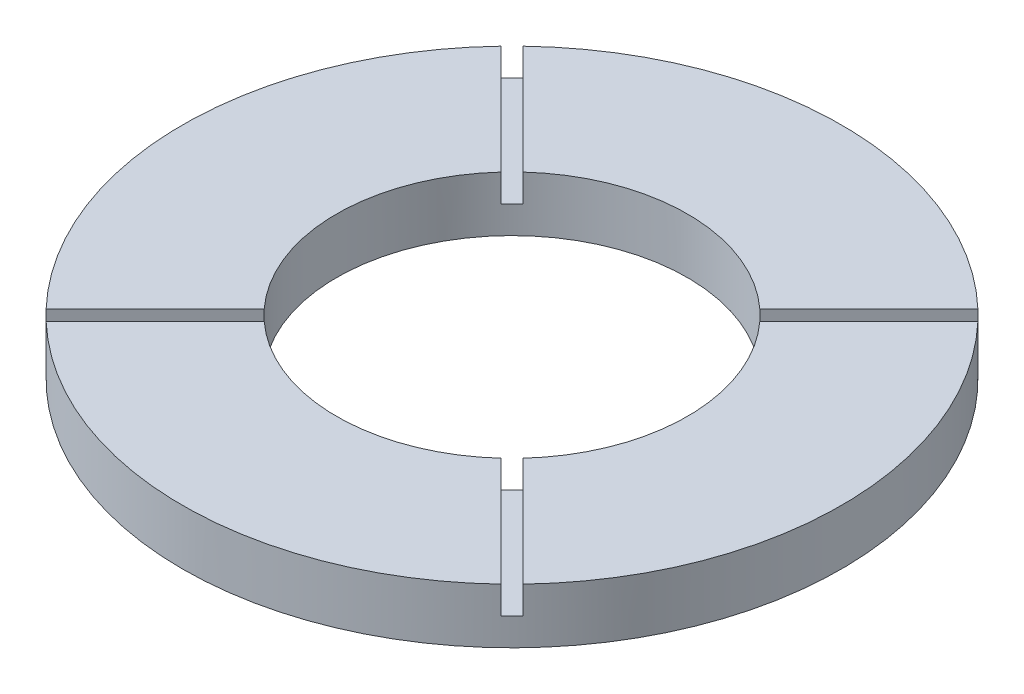
ISO-10303-21;
HEADER;
FILE_DESCRIPTION(('STEP AP214'),'2;1');
FILE_NAME('part.step','',(''),(''),'','','');
FILE_SCHEMA(('AUTOMOTIVE_DESIGN { 1 0 10303 214 1 1 1 1 }'));
ENDSEC;
DATA;
#1=APPLICATION_CONTEXT('core data for automotive mechanical design processes');
#2=APPLICATION_PROTOCOL_DEFINITION('international standard','automotive_design',2000,#1);
#3=PRODUCT_CONTEXT('',#1,'mechanical');
#4=PRODUCT('Part','Part','',(#3));
#5=PRODUCT_RELATED_PRODUCT_CATEGORY('part','',(#4));
#6=PRODUCT_DEFINITION_FORMATION('','',#4);
#7=PRODUCT_DEFINITION_CONTEXT('part definition',#1,'design');
#8=PRODUCT_DEFINITION('design','',#6,#7);
#9=PRODUCT_DEFINITION_SHAPE('','',#8);
#10=(LENGTH_UNIT() NAMED_UNIT(*) SI_UNIT(.MILLI.,.METRE.));
#11=(NAMED_UNIT(*) PLANE_ANGLE_UNIT() SI_UNIT($,.RADIAN.));
#12=(NAMED_UNIT(*) SI_UNIT($,.STERADIAN.) SOLID_ANGLE_UNIT());
#13=UNCERTAINTY_MEASURE_WITH_UNIT(LENGTH_MEASURE(1.E-05),#10,'distance_accuracy_value','');
#14=(GEOMETRIC_REPRESENTATION_CONTEXT(3) GLOBAL_UNCERTAINTY_ASSIGNED_CONTEXT((#13)) GLOBAL_UNIT_ASSIGNED_CONTEXT((#10,
#11,#12)) REPRESENTATION_CONTEXT('',''));
#15=CARTESIAN_POINT('',(0.,0.,0.));
#16=DIRECTION('',(0.,0.,1.));
#17=DIRECTION('',(1.,0.,0.));
#18=AXIS2_PLACEMENT_3D('',#15,#16,#17);
#19=CARTESIAN_POINT('',(0.,12.7,0.));
#20=DIRECTION('',(0.,1.,0.));
#21=DIRECTION('',(0.,0.,1.));
#22=AXIS2_PLACEMENT_3D('',#19,#20,#21);
#23=PLANE('',#22);
#24=DIRECTION('',(0.707106781186543,0.,-0.707106781186552));
#25=VECTOR('',#24,1.);
#26=CARTESIAN_POINT('',(-25.7014930184937,12.7,28.1800437079154));
#27=LINE('',#26,#25);
#28=CARTESIAN_POINT('',(-52.4303897259785,12.7,54.9089404154006));
#29=VERTEX_POINT('',#28);
#30=CARTESIAN_POINT('',(-27.3090139490453,12.7,29.787564638467));
#31=VERTEX_POINT('',#30);
#32=EDGE_CURVE('E246',#29,#31,#27,.T.);
#33=ORIENTED_EDGE('',*,*,#32,.F.);
#34=CARTESIAN_POINT('',(0.,12.7,0.));
#35=DIRECTION('',(0.,1.,0.));
#36=DIRECTION('',(0.,0.,1.));
#37=AXIS2_PLACEMENT_3D('',#34,#35,#36);
#38=CIRCLE('',#37,75.9206);
#39=CARTESIAN_POINT('',(52.4303897259886,12.7,54.9089404153909));
#40=VERTEX_POINT('',#39);
#41=EDGE_CURVE('E189',#29,#40,#38,.T.);
#42=ORIENTED_EDGE('',*,*,#41,.T.);
#43=DIRECTION('',(0.707106781186552,0.,0.707106781186543));
#44=VECTOR('',#43,1.);
#45=CARTESIAN_POINT('',(25.7014930185064,12.7,28.180043707909));
#46=LINE('',#45,#44);
#47=CARTESIAN_POINT('',(27.3090139490553,12.7,29.7875646384578));
#48=VERTEX_POINT('',#47);
#49=EDGE_CURVE('E315',#48,#40,#46,.T.);
#50=ORIENTED_EDGE('',*,*,#49,.F.);
#51=CARTESIAN_POINT('',(0.,12.7,0.));
#52=DIRECTION('',(0.,1.,0.));
#53=DIRECTION('',(0.,0.,1.));
#54=AXIS2_PLACEMENT_3D('',#51,#52,#53);
#55=CIRCLE('',#54,40.4114);
#56=EDGE_CURVE('E254',#31,#48,#55,.T.);
#57=ORIENTED_EDGE('',*,*,#56,.F.);
#58=EDGE_LOOP('',(#33,#42,#50,#57));
#59=FACE_BOUND('',#58,.T.);
#60=ADVANCED_FACE('F43',(#59),#23,.T.);
#61=DIRECTION('',(-0.707106781186552,0.,-0.707106781186543));
#62=VECTOR('',#61,1.);
#63=CARTESIAN_POINT('',(28.1800437079215,12.7,25.7014930184939));
#64=LINE('',#63,#62);
#65=CARTESIAN_POINT('',(54.9089404154034,12.7,52.4303897259755));
#66=VERTEX_POINT('',#65);
#67=CARTESIAN_POINT('',(29.7875646384698,12.7,27.3090139490422));
#68=VERTEX_POINT('',#67);
#69=EDGE_CURVE('E319',#66,#68,#64,.T.);
#70=ORIENTED_EDGE('',*,*,#69,.F.);
#71=CARTESIAN_POINT('',(54.908940415394,12.7,-52.4303897259854));
#72=VERTEX_POINT('',#71);
#73=EDGE_CURVE('E194',#66,#72,#38,.T.);
#74=ORIENTED_EDGE('',*,*,#73,.T.);
#75=DIRECTION('',(0.707106781186543,0.,-0.707106781186552));
#76=VECTOR('',#75,1.);
#77=CARTESIAN_POINT('',(28.1800437079151,12.7,-25.7014930185062));
#78=LINE('',#77,#76);
#79=CARTESIAN_POINT('',(29.7875646384609,12.7,-27.309013949052));
#80=VERTEX_POINT('',#79);
#81=EDGE_CURVE('E328',#80,#72,#78,.T.);
#82=ORIENTED_EDGE('',*,*,#81,.F.);
#83=EDGE_CURVE('E204',#68,#80,#55,.T.);
#84=ORIENTED_EDGE('',*,*,#83,.F.);
#85=EDGE_LOOP('',(#70,#74,#82,#84));
#86=FACE_BOUND('',#85,.T.);
#87=ADVANCED_FACE('F346',(#86),#23,.T.);
#88=DIRECTION('',(-0.707106781186543,0.,0.707106781186552));
#89=VECTOR('',#88,1.);
#90=CARTESIAN_POINT('',(25.7014930185,12.7,-28.1800437079212));
#91=LINE('',#90,#89);
#92=CARTESIAN_POINT('',(52.4303897259788,12.7,-54.9089404154003));
#93=VERTEX_POINT('',#92);
#94=CARTESIAN_POINT('',(27.3090139490455,12.7,-29.7875646384668));
#95=VERTEX_POINT('',#94);
#96=EDGE_CURVE('E180',#93,#95,#91,.T.);
#97=ORIENTED_EDGE('',*,*,#96,.F.);
#98=CARTESIAN_POINT('',(-52.4303897259824,12.7,-54.9089404153968));
#99=VERTEX_POINT('',#98);
#100=EDGE_CURVE('E188',#93,#99,#38,.T.);
#101=ORIENTED_EDGE('',*,*,#100,.T.);
#102=DIRECTION('',(-0.707106781186552,0.,-0.707106781186544));
#103=VECTOR('',#102,1.);
#104=CARTESIAN_POINT('',(-25.7014930185001,12.7,-28.1800437079149));
#105=LINE('',#104,#103);
#106=CARTESIAN_POINT('',(-27.3090139490489,12.7,-29.7875646384637));
#107=VERTEX_POINT('',#106);
#108=EDGE_CURVE('E179',#107,#99,#105,.T.);
#109=ORIENTED_EDGE('',*,*,#108,.F.);
#110=EDGE_CURVE('E253',#95,#107,#55,.T.);
#111=ORIENTED_EDGE('',*,*,#110,.F.);
#112=EDGE_LOOP('',(#97,#101,#109,#111));
#113=FACE_BOUND('',#112,.T.);
#114=ADVANCED_FACE('F376',(#113),#23,.T.);
#115=CARTESIAN_POINT('',(0.,12.7,0.));
#116=DIRECTION('',(0.,-1.,0.));
#117=DIRECTION('',(0.,0.,-1.));
#118=AXIS2_PLACEMENT_3D('',#115,#116,#117);
#119=CYLINDRICAL_SURFACE('',#118,75.9206);
#120=ORIENTED_EDGE('',*,*,#41,.F.);
#121=DIRECTION('',(0.,-1.,0.));
#122=VECTOR('',#121,1.);
#123=CARTESIAN_POINT('',(-52.4303897259785,12.7,54.9089404154006));
#124=LINE('',#123,#122);
#125=CARTESIAN_POINT('',(-52.4303897259785,6.35,54.9089404154005));
#126=VERTEX_POINT('',#125);
#127=EDGE_CURVE('E260',#29,#126,#124,.T.);
#128=ORIENTED_EDGE('',*,*,#127,.T.);
#129=CARTESIAN_POINT('',(0.,6.35,0.));
#130=DIRECTION('',(0.,-1.,0.));
#131=DIRECTION('',(0.,0.,-1.));
#132=AXIS2_PLACEMENT_3D('',#129,#130,#131);
#133=CIRCLE('',#132,75.9206);
#134=CARTESIAN_POINT('',(-54.9089404153937,6.35,52.4303897259856));
#135=VERTEX_POINT('',#134);
#136=EDGE_CURVE('E266',#126,#135,#133,.T.);
#137=ORIENTED_EDGE('',*,*,#136,.T.);
#138=DIRECTION('',(0.,-1.,0.));
#139=VECTOR('',#138,1.);
#140=CARTESIAN_POINT('',(-54.9089404153937,12.7,52.4303897259856));
#141=LINE('',#140,#139);
#142=CARTESIAN_POINT('',(-54.9089404153937,12.7,52.4303897259856));
#143=VERTEX_POINT('',#142);
#144=EDGE_CURVE('E186',#135,#143,#141,.F.);
#145=ORIENTED_EDGE('',*,*,#144,.T.);
#146=CARTESIAN_POINT('',(-54.9089404153974,12.7,-52.4303897259818));
#147=VERTEX_POINT('',#146);
#148=EDGE_CURVE('E175',#147,#143,#38,.T.);
#149=ORIENTED_EDGE('',*,*,#148,.F.);
#150=DIRECTION('',(0.,-1.,0.));
#151=VECTOR('',#150,1.);
#152=CARTESIAN_POINT('',(-54.9089404153974,12.7,-52.4303897259817));
#153=LINE('',#152,#151);
#154=CARTESIAN_POINT('',(-54.9089404153974,6.35,-52.4303897259817));
#155=VERTEX_POINT('',#154);
#156=EDGE_CURVE('E156',#147,#155,#153,.T.);
#157=ORIENTED_EDGE('',*,*,#156,.T.);
#158=CARTESIAN_POINT('',(0.,6.35,0.));
#159=DIRECTION('',(0.,-1.,0.));
#160=DIRECTION('',(0.,0.,-1.));
#161=AXIS2_PLACEMENT_3D('',#158,#159,#160);
#162=CIRCLE('',#161,75.9206);
#163=CARTESIAN_POINT('',(-52.4303897259824,6.35,-54.9089404153968));
#164=VERTEX_POINT('',#163);
#165=EDGE_CURVE('E295',#155,#164,#162,.T.);
#166=ORIENTED_EDGE('',*,*,#165,.T.);
#167=DIRECTION('',(0.,-1.,0.));
#168=VECTOR('',#167,1.);
#169=CARTESIAN_POINT('',(-52.4303897259824,12.7,-54.9089404153968));
#170=LINE('',#169,#168);
#171=EDGE_CURVE('E168',#164,#99,#170,.F.);
#172=ORIENTED_EDGE('',*,*,#171,.T.);
#173=ORIENTED_EDGE('',*,*,#100,.F.);
#174=DIRECTION('',(0.,-1.,0.));
#175=VECTOR('',#174,1.);
#176=CARTESIAN_POINT('',(52.4303897259787,12.7,-54.9089404154003));
#177=LINE('',#176,#175);
#178=CARTESIAN_POINT('',(52.4303897259788,6.35,-54.9089404154003));
#179=VERTEX_POINT('',#178);
#180=EDGE_CURVE('E281',#93,#179,#177,.T.);
#181=ORIENTED_EDGE('',*,*,#180,.T.);
#182=CARTESIAN_POINT('',(0.,6.35,0.));
#183=DIRECTION('',(0.,-1.,0.));
#184=DIRECTION('',(0.,0.,-1.));
#185=AXIS2_PLACEMENT_3D('',#182,#183,#184);
#186=CIRCLE('',#185,75.9206);
#187=CARTESIAN_POINT('',(54.908940415394,6.35,-52.4303897259854));
#188=VERTEX_POINT('',#187);
#189=EDGE_CURVE('E167',#179,#188,#186,.T.);
#190=ORIENTED_EDGE('',*,*,#189,.T.);
#191=DIRECTION('',(0.,-1.,0.));
#192=VECTOR('',#191,1.);
#193=CARTESIAN_POINT('',(54.908940415394,12.7,-52.4303897259854));
#194=LINE('',#193,#192);
#195=EDGE_CURVE('E285',#188,#72,#194,.F.);
#196=ORIENTED_EDGE('',*,*,#195,.T.);
#197=ORIENTED_EDGE('',*,*,#73,.F.);
#198=DIRECTION('',(0.,-1.,0.));
#199=VECTOR('',#198,1.);
#200=CARTESIAN_POINT('',(54.9089404154034,12.7,52.4303897259755));
#201=LINE('',#200,#199);
#202=CARTESIAN_POINT('',(54.9089404154034,6.35,52.4303897259755));
#203=VERTEX_POINT('',#202);
#204=EDGE_CURVE('E269',#66,#203,#201,.T.);
#205=ORIENTED_EDGE('',*,*,#204,.T.);
#206=CARTESIAN_POINT('',(0.,6.35,0.));
#207=DIRECTION('',(0.,-1.,0.));
#208=DIRECTION('',(0.,0.,-1.));
#209=AXIS2_PLACEMENT_3D('',#206,#207,#208);
#210=CIRCLE('',#209,75.9206);
#211=CARTESIAN_POINT('',(52.4303897259886,6.35,54.9089404153909));
#212=VERTEX_POINT('',#211);
#213=EDGE_CURVE('E277',#203,#212,#210,.T.);
#214=ORIENTED_EDGE('',*,*,#213,.T.);
#215=DIRECTION('',(0.,-1.,0.));
#216=VECTOR('',#215,1.);
#217=CARTESIAN_POINT('',(52.4303897259886,12.7,54.9089404153909));
#218=LINE('',#217,#216);
#219=EDGE_CURVE('E273',#212,#40,#218,.F.);
#220=ORIENTED_EDGE('',*,*,#219,.T.);
#221=EDGE_LOOP('',(#120,#128,#137,#145,#149,#157,#166,#172,#173,#181,#190,#196,#197,#205,#214,#220));
#222=FACE_BOUND('',#221,.T.);
#223=CARTESIAN_POINT('',(0.,0.,0.));
#224=DIRECTION('',(0.,1.,0.));
#225=DIRECTION('',(0.,0.,1.));
#226=AXIS2_PLACEMENT_3D('',#223,#224,#225);
#227=CIRCLE('',#226,75.9206);
#228=CARTESIAN_POINT('',(0.,0.,75.9206));
#229=VERTEX_POINT('',#228);
#230=EDGE_CURVE('E196',#229,#229,#227,.T.);
#231=ORIENTED_EDGE('',*,*,#230,.T.);
#232=EDGE_LOOP('',(#231));
#233=FACE_BOUND('',#232,.T.);
#234=ADVANCED_FACE('F45',(#222,#233),#119,.T.);
#235=DIRECTION('',(-0.707106781186543,0.,0.707106781186552));
#236=VECTOR('',#235,1.);
#237=CARTESIAN_POINT('',(-28.1800437079088,12.7,25.7014930185003));
#238=LINE('',#237,#236);
#239=CARTESIAN_POINT('',(-29.7875646384606,12.7,27.3090139490522));
#240=VERTEX_POINT('',#239);
#241=EDGE_CURVE('E240',#240,#143,#238,.T.);
#242=ORIENTED_EDGE('',*,*,#241,.F.);
#243=CARTESIAN_POINT('',(-29.787564638464,12.7,-27.3090139490486));
#244=VERTEX_POINT('',#243);
#245=EDGE_CURVE('E177',#244,#240,#55,.T.);
#246=ORIENTED_EDGE('',*,*,#245,.F.);
#247=DIRECTION('',(0.707106781186552,0.,0.707106781186543));
#248=VECTOR('',#247,1.);
#249=CARTESIAN_POINT('',(-28.1800437079152,12.7,-25.7014930184998));
#250=LINE('',#249,#248);
#251=EDGE_CURVE('E160',#147,#244,#250,.T.);
#252=ORIENTED_EDGE('',*,*,#251,.F.);
#253=ORIENTED_EDGE('',*,*,#148,.T.);
#254=EDGE_LOOP('',(#242,#246,#252,#253));
#255=FACE_BOUND('',#254,.T.);
#256=ADVANCED_FACE('F174',(#255),#23,.T.);
#257=CARTESIAN_POINT('',(0.,0.,0.));
#258=DIRECTION('',(0.,1.,0.));
#259=DIRECTION('',(0.,0.,1.));
#260=AXIS2_PLACEMENT_3D('',#257,#258,#259);
#261=PLANE('',#260);
#262=CARTESIAN_POINT('',(0.,0.,0.));
#263=DIRECTION('',(0.,1.,0.));
#264=DIRECTION('',(0.,0.,1.));
#265=AXIS2_PLACEMENT_3D('',#262,#263,#264);
#266=CIRCLE('',#265,40.4114);
#267=CARTESIAN_POINT('',(0.,0.,40.4114));
#268=VERTEX_POINT('',#267);
#269=EDGE_CURVE('E199',#268,#268,#266,.T.);
#270=ORIENTED_EDGE('',*,*,#269,.T.);
#271=EDGE_LOOP('',(#270));
#272=FACE_BOUND('',#271,.T.);
#273=ORIENTED_EDGE('',*,*,#230,.F.);
#274=EDGE_LOOP('',(#273));
#275=FACE_BOUND('',#274,.T.);
#276=ADVANCED_FACE('F379',(#272,#275),#261,.F.);
#277=CARTESIAN_POINT('',(0.,12.7,0.));
#278=DIRECTION('',(0.,-1.,0.));
#279=DIRECTION('',(0.,0.,-1.));
#280=AXIS2_PLACEMENT_3D('',#277,#278,#279);
#281=CYLINDRICAL_SURFACE('',#280,40.4114);
#282=DIRECTION('',(0.,-1.,0.));
#283=VECTOR('',#282,1.);
#284=CARTESIAN_POINT('',(-27.3090139490453,12.7,29.787564638467));
#285=LINE('',#284,#283);
#286=CARTESIAN_POINT('',(-27.3090139490453,6.35,29.787564638467));
#287=VERTEX_POINT('',#286);
#288=EDGE_CURVE('E11',#31,#287,#285,.T.);
#289=ORIENTED_EDGE('',*,*,#288,.F.);
#290=ORIENTED_EDGE('',*,*,#56,.T.);
#291=DIRECTION('',(0.,-1.,0.));
#292=VECTOR('',#291,1.);
#293=CARTESIAN_POINT('',(27.3090139490553,12.7,29.7875646384578));
#294=LINE('',#293,#292);
#295=CARTESIAN_POINT('',(27.3090139490553,6.35,29.7875646384578));
#296=VERTEX_POINT('',#295);
#297=EDGE_CURVE('E227',#296,#48,#294,.F.);
#298=ORIENTED_EDGE('',*,*,#297,.F.);
#299=CARTESIAN_POINT('',(0.,6.35,0.));
#300=DIRECTION('',(0.,-1.,0.));
#301=DIRECTION('',(0.,0.,-1.));
#302=AXIS2_PLACEMENT_3D('',#299,#300,#301);
#303=CIRCLE('',#302,40.4114);
#304=CARTESIAN_POINT('',(29.7875646384698,6.35,27.3090139490422));
#305=VERTEX_POINT('',#304);
#306=EDGE_CURVE('E224',#305,#296,#303,.T.);
#307=ORIENTED_EDGE('',*,*,#306,.F.);
#308=DIRECTION('',(0.,-1.,0.));
#309=VECTOR('',#308,1.);
#310=CARTESIAN_POINT('',(29.7875646384698,12.7,27.3090139490422));
#311=LINE('',#310,#309);
#312=EDGE_CURVE('E230',#68,#305,#311,.T.);
#313=ORIENTED_EDGE('',*,*,#312,.F.);
#314=ORIENTED_EDGE('',*,*,#83,.T.);
#315=DIRECTION('',(0.,-1.,0.));
#316=VECTOR('',#315,1.);
#317=CARTESIAN_POINT('',(29.7875646384609,12.7,-27.309013949052));
#318=LINE('',#317,#316);
#319=CARTESIAN_POINT('',(29.7875646384609,6.35,-27.309013949052));
#320=VERTEX_POINT('',#319);
#321=EDGE_CURVE('E217',#320,#80,#318,.F.);
#322=ORIENTED_EDGE('',*,*,#321,.F.);
#323=CARTESIAN_POINT('',(0.,6.35,0.));
#324=DIRECTION('',(0.,-1.,0.));
#325=DIRECTION('',(0.,0.,-1.));
#326=AXIS2_PLACEMENT_3D('',#323,#324,#325);
#327=CIRCLE('',#326,40.4114);
#328=CARTESIAN_POINT('',(27.3090139490455,6.35,-29.7875646384668));
#329=VERTEX_POINT('',#328);
#330=EDGE_CURVE('E214',#329,#320,#327,.T.);
#331=ORIENTED_EDGE('',*,*,#330,.F.);
#332=DIRECTION('',(0.,-1.,0.));
#333=VECTOR('',#332,1.);
#334=CARTESIAN_POINT('',(27.3090139490455,12.7,-29.7875646384668));
#335=LINE('',#334,#333);
#336=EDGE_CURVE('E220',#95,#329,#335,.T.);
#337=ORIENTED_EDGE('',*,*,#336,.F.);
#338=ORIENTED_EDGE('',*,*,#110,.T.);
#339=DIRECTION('',(0.,-1.,0.));
#340=VECTOR('',#339,1.);
#341=CARTESIAN_POINT('',(-27.3090139490489,12.7,-29.7875646384637));
#342=LINE('',#341,#340);
#343=CARTESIAN_POINT('',(-27.3090139490489,6.35,-29.7875646384637));
#344=VERTEX_POINT('',#343);
#345=EDGE_CURVE('E208',#344,#107,#342,.F.);
#346=ORIENTED_EDGE('',*,*,#345,.F.);
#347=CARTESIAN_POINT('',(0.,6.35,0.));
#348=DIRECTION('',(0.,-1.,0.));
#349=DIRECTION('',(0.,0.,-1.));
#350=AXIS2_PLACEMENT_3D('',#347,#348,#349);
#351=CIRCLE('',#350,40.4114);
#352=CARTESIAN_POINT('',(-29.787564638464,6.35,-27.3090139490486));
#353=VERTEX_POINT('',#352);
#354=EDGE_CURVE('E205',#353,#344,#351,.T.);
#355=ORIENTED_EDGE('',*,*,#354,.F.);
#356=DIRECTION('',(0.,-1.,0.));
#357=VECTOR('',#356,1.);
#358=CARTESIAN_POINT('',(-29.787564638464,12.7,-27.3090139490486));
#359=LINE('',#358,#357);
#360=EDGE_CURVE('E211',#244,#353,#359,.T.);
#361=ORIENTED_EDGE('',*,*,#360,.F.);
#362=ORIENTED_EDGE('',*,*,#245,.T.);
#363=DIRECTION('',(0.,-1.,0.));
#364=VECTOR('',#363,1.);
#365=CARTESIAN_POINT('',(-29.7875646384606,12.7,27.3090139490522));
#366=LINE('',#365,#364);
#367=CARTESIAN_POINT('',(-29.7875646384606,6.35,27.3090139490522));
#368=VERTEX_POINT('',#367);
#369=EDGE_CURVE('E52',#368,#240,#366,.F.);
#370=ORIENTED_EDGE('',*,*,#369,.F.);
#371=CARTESIAN_POINT('',(0.,6.35,0.));
#372=DIRECTION('',(0.,-1.,0.));
#373=DIRECTION('',(0.,0.,-1.));
#374=AXIS2_PLACEMENT_3D('',#371,#372,#373);
#375=CIRCLE('',#374,40.4114);
#376=EDGE_CURVE('E233',#287,#368,#375,.T.);
#377=ORIENTED_EDGE('',*,*,#376,.F.);
#378=EDGE_LOOP('',(#289,#290,#298,#307,#313,#314,#322,#331,#337,#338,#346,#355,#361,#362,#370,#377));
#379=FACE_BOUND('',#378,.T.);
#380=ORIENTED_EDGE('',*,*,#269,.F.);
#381=EDGE_LOOP('',(#380));
#382=FACE_BOUND('',#381,.T.);
#383=ADVANCED_FACE('F249',(#379,#382),#281,.F.);
#384=CARTESIAN_POINT('',(-28.1800437079152,6.35,-25.7014930184998));
#385=DIRECTION('',(-0.707106781186543,0.,0.707106781186551));
#386=DIRECTION('',(0.707106781186552,0.,0.707106781186544));
#387=AXIS2_PLACEMENT_3D('',#384,#385,#386);
#388=PLANE('',#387);
#389=ORIENTED_EDGE('',*,*,#251,.T.);
#390=ORIENTED_EDGE('',*,*,#360,.T.);
#391=DIRECTION('',(0.707106781186552,0.,0.707106781186543));
#392=VECTOR('',#391,1.);
#393=CARTESIAN_POINT('',(-28.1800437079152,6.35,-25.7014930184998));
#394=LINE('',#393,#392);
#395=EDGE_CURVE('E162',#155,#353,#394,.T.);
#396=ORIENTED_EDGE('',*,*,#395,.F.);
#397=ORIENTED_EDGE('',*,*,#156,.F.);
#398=EDGE_LOOP('',(#389,#390,#396,#397));
#399=FACE_BOUND('',#398,.T.);
#400=ADVANCED_FACE('F158',(#399),#388,.F.);
#401=CARTESIAN_POINT('',(-25.7014930185001,6.35,-28.1800437079149));
#402=DIRECTION('',(0.707106781186543,0.,-0.707106781186552));
#403=DIRECTION('',(-0.707106781186552,0.,-0.707106781186543));
#404=AXIS2_PLACEMENT_3D('',#401,#402,#403);
#405=PLANE('',#404);
#406=DIRECTION('',(-0.707106781186552,0.,-0.707106781186544));
#407=VECTOR('',#406,1.);
#408=CARTESIAN_POINT('',(-25.7014930185001,6.35,-28.1800437079149));
#409=LINE('',#408,#407);
#410=EDGE_CURVE('E298',#344,#164,#409,.T.);
#411=ORIENTED_EDGE('',*,*,#410,.F.);
#412=ORIENTED_EDGE('',*,*,#345,.T.);
#413=ORIENTED_EDGE('',*,*,#108,.T.);
#414=ORIENTED_EDGE('',*,*,#171,.F.);
#415=EDGE_LOOP('',(#411,#412,#413,#414));
#416=FACE_BOUND('',#415,.T.);
#417=ADVANCED_FACE('F397',(#416),#405,.F.);
#418=CARTESIAN_POINT('',(0.,6.35,0.));
#419=DIRECTION('',(0.,-1.,0.));
#420=DIRECTION('',(0.,0.,-1.));
#421=AXIS2_PLACEMENT_3D('',#418,#419,#420);
#422=PLANE('',#421);
#423=ORIENTED_EDGE('',*,*,#395,.T.);
#424=ORIENTED_EDGE('',*,*,#354,.T.);
#425=ORIENTED_EDGE('',*,*,#410,.T.);
#426=ORIENTED_EDGE('',*,*,#165,.F.);
#427=EDGE_LOOP('',(#423,#424,#425,#426));
#428=FACE_BOUND('',#427,.T.);
#429=ADVANCED_FACE('F400',(#428),#422,.F.);
#430=CARTESIAN_POINT('',(25.7014930185,6.35,-28.1800437079212));
#431=DIRECTION('',(-0.707106781186551,0.,-0.707106781186543));
#432=DIRECTION('',(-0.707106781186544,0.,0.707106781186552));
#433=AXIS2_PLACEMENT_3D('',#430,#431,#432);
#434=PLANE('',#433);
#435=ORIENTED_EDGE('',*,*,#96,.T.);
#436=ORIENTED_EDGE('',*,*,#336,.T.);
#437=DIRECTION('',(-0.707106781186543,0.,0.707106781186552));
#438=VECTOR('',#437,1.);
#439=CARTESIAN_POINT('',(25.7014930185,6.35,-28.1800437079212));
#440=LINE('',#439,#438);
#441=EDGE_CURVE('E325',#179,#329,#440,.T.);
#442=ORIENTED_EDGE('',*,*,#441,.F.);
#443=ORIENTED_EDGE('',*,*,#180,.F.);
#444=EDGE_LOOP('',(#435,#436,#442,#443));
#445=FACE_BOUND('',#444,.T.);
#446=ADVANCED_FACE('F403',(#445),#434,.F.);
#447=CARTESIAN_POINT('',(28.1800437079151,6.35,-25.7014930185062));
#448=DIRECTION('',(0.707106781186551,0.,0.707106781186543));
#449=DIRECTION('',(0.707106781186544,0.,-0.707106781186552));
#450=AXIS2_PLACEMENT_3D('',#447,#448,#449);
#451=PLANE('',#450);
#452=DIRECTION('',(0.707106781186543,0.,-0.707106781186552));
#453=VECTOR('',#452,1.);
#454=CARTESIAN_POINT('',(28.1800437079151,6.35,-25.7014930185062));
#455=LINE('',#454,#453);
#456=EDGE_CURVE('E322',#320,#188,#455,.T.);
#457=ORIENTED_EDGE('',*,*,#456,.F.);
#458=ORIENTED_EDGE('',*,*,#321,.T.);
#459=ORIENTED_EDGE('',*,*,#81,.T.);
#460=ORIENTED_EDGE('',*,*,#195,.F.);
#461=EDGE_LOOP('',(#457,#458,#459,#460));
#462=FACE_BOUND('',#461,.T.);
#463=ADVANCED_FACE('F338',(#462),#451,.F.);
#464=CARTESIAN_POINT('',(0.,6.35,0.));
#465=DIRECTION('',(0.,-1.,0.));
#466=DIRECTION('',(0.,0.,-1.));
#467=AXIS2_PLACEMENT_3D('',#464,#465,#466);
#468=PLANE('',#467);
#469=ORIENTED_EDGE('',*,*,#441,.T.);
#470=ORIENTED_EDGE('',*,*,#330,.T.);
#471=ORIENTED_EDGE('',*,*,#456,.T.);
#472=ORIENTED_EDGE('',*,*,#189,.F.);
#473=EDGE_LOOP('',(#469,#470,#471,#472));
#474=FACE_BOUND('',#473,.T.);
#475=ADVANCED_FACE('F405',(#474),#468,.F.);
#476=CARTESIAN_POINT('',(28.1800437079215,6.35,25.7014930184939));
#477=DIRECTION('',(0.707106781186543,0.,-0.707106781186552));
#478=DIRECTION('',(-0.707106781186552,0.,-0.707106781186543));
#479=AXIS2_PLACEMENT_3D('',#476,#477,#478);
#480=PLANE('',#479);
#481=ORIENTED_EDGE('',*,*,#69,.T.);
#482=ORIENTED_EDGE('',*,*,#312,.T.);
#483=DIRECTION('',(-0.707106781186552,0.,-0.707106781186543));
#484=VECTOR('',#483,1.);
#485=CARTESIAN_POINT('',(28.1800437079215,6.35,25.7014930184939));
#486=LINE('',#485,#484);
#487=EDGE_CURVE('E66',#203,#305,#486,.T.);
#488=ORIENTED_EDGE('',*,*,#487,.F.);
#489=ORIENTED_EDGE('',*,*,#204,.F.);
#490=EDGE_LOOP('',(#481,#482,#488,#489));
#491=FACE_BOUND('',#490,.T.);
#492=ADVANCED_FACE('F350',(#491),#480,.F.);
#493=CARTESIAN_POINT('',(25.7014930185064,6.35,28.180043707909));
#494=DIRECTION('',(-0.707106781186543,0.,0.707106781186552));
#495=DIRECTION('',(0.707106781186552,0.,0.707106781186543));
#496=AXIS2_PLACEMENT_3D('',#493,#494,#495);
#497=PLANE('',#496);
#498=DIRECTION('',(0.707106781186552,0.,0.707106781186543));
#499=VECTOR('',#498,1.);
#500=CARTESIAN_POINT('',(25.7014930185064,6.35,28.180043707909));
#501=LINE('',#500,#499);
#502=EDGE_CURVE('E311',#296,#212,#501,.T.);
#503=ORIENTED_EDGE('',*,*,#502,.F.);
#504=ORIENTED_EDGE('',*,*,#297,.T.);
#505=ORIENTED_EDGE('',*,*,#49,.T.);
#506=ORIENTED_EDGE('',*,*,#219,.F.);
#507=EDGE_LOOP('',(#503,#504,#505,#506));
#508=FACE_BOUND('',#507,.T.);
#509=ADVANCED_FACE('F356',(#508),#497,.F.);
#510=CARTESIAN_POINT('',(0.,6.35,0.));
#511=DIRECTION('',(0.,-1.,0.));
#512=DIRECTION('',(0.,0.,-1.));
#513=AXIS2_PLACEMENT_3D('',#510,#511,#512);
#514=PLANE('',#513);
#515=ORIENTED_EDGE('',*,*,#487,.T.);
#516=ORIENTED_EDGE('',*,*,#306,.T.);
#517=ORIENTED_EDGE('',*,*,#502,.T.);
#518=ORIENTED_EDGE('',*,*,#213,.F.);
#519=EDGE_LOOP('',(#515,#516,#517,#518));
#520=FACE_BOUND('',#519,.T.);
#521=ADVANCED_FACE('F354',(#520),#514,.F.);
#522=CARTESIAN_POINT('',(-25.7014930184937,6.35,28.1800437079154));
#523=DIRECTION('',(0.707106781186552,0.,0.707106781186543));
#524=DIRECTION('',(0.707106781186543,0.,-0.707106781186552));
#525=AXIS2_PLACEMENT_3D('',#522,#523,#524);
#526=PLANE('',#525);
#527=ORIENTED_EDGE('',*,*,#32,.T.);
#528=ORIENTED_EDGE('',*,*,#288,.T.);
#529=DIRECTION('',(0.707106781186543,0.,-0.707106781186552));
#530=VECTOR('',#529,1.);
#531=CARTESIAN_POINT('',(-25.7014930184937,6.35,28.1800437079154));
#532=LINE('',#531,#530);
#533=EDGE_CURVE('E59',#126,#287,#532,.T.);
#534=ORIENTED_EDGE('',*,*,#533,.F.);
#535=ORIENTED_EDGE('',*,*,#127,.F.);
#536=EDGE_LOOP('',(#527,#528,#534,#535));
#537=FACE_BOUND('',#536,.T.);
#538=ADVANCED_FACE('F362',(#537),#526,.F.);
#539=CARTESIAN_POINT('',(-28.1800437079088,6.35,25.7014930185003));
#540=DIRECTION('',(-0.707106781186552,0.,-0.707106781186543));
#541=DIRECTION('',(-0.707106781186543,0.,0.707106781186552));
#542=AXIS2_PLACEMENT_3D('',#539,#540,#541);
#543=PLANE('',#542);
#544=DIRECTION('',(-0.707106781186543,0.,0.707106781186552));
#545=VECTOR('',#544,1.);
#546=CARTESIAN_POINT('',(-28.1800437079088,6.35,25.7014930185003));
#547=LINE('',#546,#545);
#548=EDGE_CURVE('E242',#368,#135,#547,.T.);
#549=ORIENTED_EDGE('',*,*,#548,.F.);
#550=ORIENTED_EDGE('',*,*,#369,.T.);
#551=ORIENTED_EDGE('',*,*,#241,.T.);
#552=ORIENTED_EDGE('',*,*,#144,.F.);
#553=EDGE_LOOP('',(#549,#550,#551,#552));
#554=FACE_BOUND('',#553,.T.);
#555=ADVANCED_FACE('F239',(#554),#543,.F.);
#556=CARTESIAN_POINT('',(0.,6.35,0.));
#557=DIRECTION('',(0.,-1.,0.));
#558=DIRECTION('',(0.,0.,-1.));
#559=AXIS2_PLACEMENT_3D('',#556,#557,#558);
#560=PLANE('',#559);
#561=ORIENTED_EDGE('',*,*,#533,.T.);
#562=ORIENTED_EDGE('',*,*,#376,.T.);
#563=ORIENTED_EDGE('',*,*,#548,.T.);
#564=ORIENTED_EDGE('',*,*,#136,.F.);
#565=EDGE_LOOP('',(#561,#562,#563,#564));
#566=FACE_BOUND('',#565,.T.);
#567=ADVANCED_FACE('F363',(#566),#560,.F.);
#568=CLOSED_SHELL('',(#60,#87,#114,#234,#256,#276,#383,#400,#417,#429,#446,#463,#475,#492,#509,
#521,#538,#555,#567));
#569=MANIFOLD_SOLID_BREP('B2',#568);
#570=ADVANCED_BREP_SHAPE_REPRESENTATION('',(#18,#569),#14);
#571=SHAPE_DEFINITION_REPRESENTATION(#9,#570);
ENDSEC;
END-ISO-10303-21;
